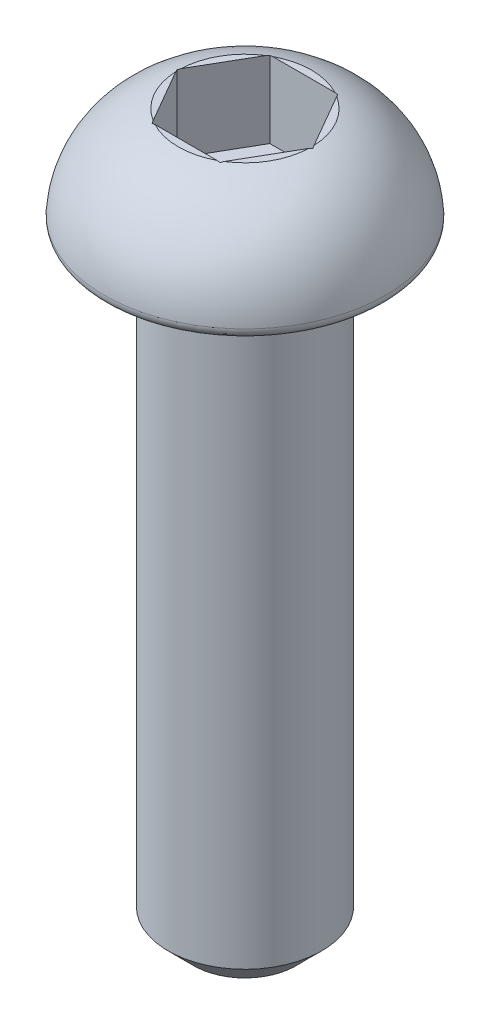
ISO-10303-21;
HEADER;
FILE_DESCRIPTION(('STEP AP214'),'2;1');
FILE_NAME('part.step','',(''),(''),'','','');
FILE_SCHEMA(('AUTOMOTIVE_DESIGN { 1 0 10303 214 1 1 1 1 }'));
ENDSEC;
DATA;
#1=APPLICATION_CONTEXT('core data for automotive mechanical design processes');
#2=APPLICATION_PROTOCOL_DEFINITION('international standard','automotive_design',2000,#1);
#3=PRODUCT_CONTEXT('',#1,'mechanical');
#4=PRODUCT('Part','Part','',(#3));
#5=PRODUCT_RELATED_PRODUCT_CATEGORY('part','',(#4));
#6=PRODUCT_DEFINITION_FORMATION('','',#4);
#7=PRODUCT_DEFINITION_CONTEXT('part definition',#1,'design');
#8=PRODUCT_DEFINITION('design','',#6,#7);
#9=PRODUCT_DEFINITION_SHAPE('','',#8);
#10=(LENGTH_UNIT() NAMED_UNIT(*) SI_UNIT(.MILLI.,.METRE.));
#11=(NAMED_UNIT(*) PLANE_ANGLE_UNIT() SI_UNIT($,.RADIAN.));
#12=(NAMED_UNIT(*) SI_UNIT($,.STERADIAN.) SOLID_ANGLE_UNIT());
#13=UNCERTAINTY_MEASURE_WITH_UNIT(LENGTH_MEASURE(1.E-05),#10,'distance_accuracy_value','');
#14=(GEOMETRIC_REPRESENTATION_CONTEXT(3) GLOBAL_UNCERTAINTY_ASSIGNED_CONTEXT((#13)) GLOBAL_UNIT_ASSIGNED_CONTEXT((#10,
#11,#12)) REPRESENTATION_CONTEXT('',''));
#15=CARTESIAN_POINT('',(0.,0.,0.));
#16=DIRECTION('',(0.,0.,1.));
#17=DIRECTION('',(1.,0.,0.));
#18=AXIS2_PLACEMENT_3D('',#15,#16,#17);
#19=CARTESIAN_POINT('',(0.,0.,0.));
#20=DIRECTION('',(0.,-1.,0.));
#21=DIRECTION('',(0.,0.,-1.));
#22=AXIS2_PLACEMENT_3D('',#19,#20,#21);
#23=PLANE('',#22);
#24=CARTESIAN_POINT('',(0.,0.,0.));
#25=DIRECTION('',(0.,-1.,0.));
#26=DIRECTION('',(0.,0.,-1.));
#27=AXIS2_PLACEMENT_3D('',#24,#25,#26);
#28=CIRCLE('',#27,2.54724235554234);
#29=CARTESIAN_POINT('',(0.,0.,-2.54724235554234));
#30=VERTEX_POINT('',#29);
#31=EDGE_CURVE('E186',#30,#30,#28,.T.);
#32=ORIENTED_EDGE('',*,*,#31,.T.);
#33=EDGE_LOOP('',(#32));
#34=FACE_BOUND('',#33,.T.);
#35=CARTESIAN_POINT('',(0.,0.,0.));
#36=DIRECTION('',(0.,-1.,0.));
#37=DIRECTION('',(0.,0.,-1.));
#38=AXIS2_PLACEMENT_3D('',#35,#36,#37);
#39=CIRCLE('',#38,1.5);
#40=CARTESIAN_POINT('',(0.,0.,-1.5));
#41=VERTEX_POINT('',#40);
#42=EDGE_CURVE('E152',#41,#41,#39,.T.);
#43=ORIENTED_EDGE('',*,*,#42,.F.);
#44=EDGE_LOOP('',(#43));
#45=FACE_BOUND('',#44,.T.);
#46=ADVANCED_FACE('F34',(#34,#45),#23,.T.);
#47=CARTESIAN_POINT('',(0.,2.,0.));
#48=DIRECTION('',(0.,1.,0.));
#49=DIRECTION('',(0.,0.,1.));
#50=AXIS2_PLACEMENT_3D('',#47,#48,#49);
#51=PLANE('',#50);
#52=DIRECTION('',(0.5,0.,-0.866025403784439));
#53=VECTOR('',#52,1.);
#54=CARTESIAN_POINT('',(0.66395280956807,2.,1.15));
#55=LINE('',#54,#53);
#56=CARTESIAN_POINT('',(0.692820323027552,2.,1.1));
#57=VERTEX_POINT('',#56);
#58=CARTESIAN_POINT('',(1.29903810567666,2.,0.0499999999999994));
#59=VERTEX_POINT('',#58);
#60=EDGE_CURVE('E161',#57,#59,#55,.T.);
#61=ORIENTED_EDGE('',*,*,#60,.F.);
#62=CARTESIAN_POINT('',(0.,2.,0.));
#63=DIRECTION('',(0.,-1.,0.));
#64=DIRECTION('',(0.,0.,-1.));
#65=AXIS2_PLACEMENT_3D('',#62,#63,#64);
#66=CIRCLE('',#65,1.3);
#67=EDGE_CURVE('E314',#59,#57,#66,.T.);
#68=ORIENTED_EDGE('',*,*,#67,.F.);
#69=EDGE_LOOP('',(#61,#68));
#70=FACE_BOUND('',#69,.T.);
#71=ADVANCED_FACE('F282',(#70),#51,.T.);
#72=DIRECTION('',(1.,0.,0.));
#73=VECTOR('',#72,1.);
#74=CARTESIAN_POINT('',(-0.66395280956807,2.,1.15));
#75=LINE('',#74,#73);
#76=CARTESIAN_POINT('',(-0.606217782649107,2.,1.15));
#77=VERTEX_POINT('',#76);
#78=CARTESIAN_POINT('',(0.606217782649107,2.,1.15));
#79=VERTEX_POINT('',#78);
#80=EDGE_CURVE('E147',#77,#79,#75,.T.);
#81=ORIENTED_EDGE('',*,*,#80,.F.);
#82=EDGE_CURVE('E316',#79,#77,#66,.T.);
#83=ORIENTED_EDGE('',*,*,#82,.F.);
#84=EDGE_LOOP('',(#81,#83));
#85=FACE_BOUND('',#84,.T.);
#86=ADVANCED_FACE('F288',(#85),#51,.T.);
#87=DIRECTION('',(0.5,0.,0.866025403784438));
#88=VECTOR('',#87,1.);
#89=CARTESIAN_POINT('',(-1.32790561913614,2.,0.));
#90=LINE('',#89,#88);
#91=CARTESIAN_POINT('',(-1.29903810567666,2.,0.0500000000000002));
#92=VERTEX_POINT('',#91);
#93=CARTESIAN_POINT('',(-0.692820323027551,2.,1.1));
#94=VERTEX_POINT('',#93);
#95=EDGE_CURVE('E149',#92,#94,#90,.T.);
#96=ORIENTED_EDGE('',*,*,#95,.F.);
#97=EDGE_CURVE('E318',#94,#92,#66,.T.);
#98=ORIENTED_EDGE('',*,*,#97,.F.);
#99=EDGE_LOOP('',(#96,#98));
#100=FACE_BOUND('',#99,.T.);
#101=ADVANCED_FACE('F342',(#100),#51,.T.);
#102=DIRECTION('',(-0.5,0.,0.866025403784439));
#103=VECTOR('',#102,1.);
#104=CARTESIAN_POINT('',(-0.66395280956807,2.,-1.15));
#105=LINE('',#104,#103);
#106=CARTESIAN_POINT('',(-0.692820323027551,2.,-1.1));
#107=VERTEX_POINT('',#106);
#108=CARTESIAN_POINT('',(-1.29903810567666,2.,-0.0500000000000003));
#109=VERTEX_POINT('',#108);
#110=EDGE_CURVE('E166',#107,#109,#105,.T.);
#111=ORIENTED_EDGE('',*,*,#110,.F.);
#112=EDGE_CURVE('E184',#109,#107,#66,.T.);
#113=ORIENTED_EDGE('',*,*,#112,.F.);
#114=EDGE_LOOP('',(#111,#113));
#115=FACE_BOUND('',#114,.T.);
#116=ADVANCED_FACE('F331',(#115),#51,.T.);
#117=DIRECTION('',(-1.,0.,0.));
#118=VECTOR('',#117,1.);
#119=CARTESIAN_POINT('',(0.663952809568069,2.,-1.15));
#120=LINE('',#119,#118);
#121=CARTESIAN_POINT('',(0.606217782649107,2.,-1.15));
#122=VERTEX_POINT('',#121);
#123=CARTESIAN_POINT('',(-0.606217782649107,2.,-1.15));
#124=VERTEX_POINT('',#123);
#125=EDGE_CURVE('E164',#122,#124,#120,.T.);
#126=ORIENTED_EDGE('',*,*,#125,.F.);
#127=EDGE_CURVE('E171',#124,#122,#66,.T.);
#128=ORIENTED_EDGE('',*,*,#127,.F.);
#129=EDGE_LOOP('',(#126,#128));
#130=FACE_BOUND('',#129,.T.);
#131=ADVANCED_FACE('F307',(#130),#51,.T.);
#132=DIRECTION('',(-0.5,0.,-0.866025403784438));
#133=VECTOR('',#132,1.);
#134=CARTESIAN_POINT('',(1.32790561913614,2.,0.));
#135=LINE('',#134,#133);
#136=CARTESIAN_POINT('',(1.29903810567666,2.,-0.0499999999999994));
#137=VERTEX_POINT('',#136);
#138=CARTESIAN_POINT('',(0.69282032302755,2.,-1.1));
#139=VERTEX_POINT('',#138);
#140=EDGE_CURVE('E49',#137,#139,#135,.T.);
#141=ORIENTED_EDGE('',*,*,#140,.F.);
#142=EDGE_CURVE('E185',#139,#137,#66,.T.);
#143=ORIENTED_EDGE('',*,*,#142,.F.);
#144=EDGE_LOOP('',(#141,#143));
#145=FACE_BOUND('',#144,.T.);
#146=ADVANCED_FACE('F290',(#145),#51,.T.);
#147=CARTESIAN_POINT('',(0.,0.076691427643514,0.));
#148=DIRECTION('',(0.,-1.,0.));
#149=DIRECTION('',(0.,0.,-1.));
#150=AXIS2_PLACEMENT_3D('',#147,#148,#149);
#151=DEGENERATE_TOROIDAL_SURFACE('',#150,0.751470934680709,2.,.T.);
#152=CARTESIAN_POINT('',(0.663837339514232,1.99178669993929,1.1502));
#153=CARTESIAN_POINT('',(0.66878717333089,1.99327644137946,1.14162663634053));
#154=CARTESIAN_POINT('',(0.673740102582228,1.99472242054365,1.13304791123091));
#155=CARTESIAN_POINT('',(0.683652150360132,1.99752685386907,1.11587974087253));
#156=CARTESIAN_POINT('',(0.688611268884708,1.99888530805844,1.10729029562721));
#157=CARTESIAN_POINT('',(0.693573482841972,2.0002,1.0986954889352));
#158=B_SPLINE_CURVE_WITH_KNOTS('',3,(#152,#153,#154,#155,#156,#157),.UNSPECIFIED.,.F.,.F.,(4,2,
4),(0.,0.0300325156416312,0.0600650216231519),.UNSPECIFIED.);
#159=CARTESIAN_POINT('',(0.66395280956807,1.99182146358279,1.15));
#160=VERTEX_POINT('',#159);
#161=EDGE_CURVE('E264',#160,#57,#158,.T.);
#162=ORIENTED_EDGE('',*,*,#161,.F.);
#163=CARTESIAN_POINT('',(0.,2.03658290017349,1.15));
#164=CARTESIAN_POINT('',(0.098646218600147,2.03658732143362,1.15));
#165=CARTESIAN_POINT('',(0.197295101956486,2.03408796152423,1.15));
#166=CARTESIAN_POINT('',(0.394304837949951,2.02310682474313,1.15));
#167=CARTESIAN_POINT('',(0.492665658489158,2.01462440489486,1.15));
#168=CARTESIAN_POINT('',(0.687609728686378,1.98957726871187,1.15));
#169=CARTESIAN_POINT('',(0.784200929312974,1.97307885273518,1.15));
#170=CARTESIAN_POINT('',(0.975057818596466,1.93000622100407,1.15));
#171=CARTESIAN_POINT('',(1.06932598789786,1.90344329758489,1.15));
#172=CARTESIAN_POINT('',(1.27000942224647,1.83324426296719,1.15));
#173=CARTESIAN_POINT('',(1.37568972004873,1.78744372549576,1.15));
#174=CARTESIAN_POINT('',(1.57845042818664,1.67924757225634,1.15));
#175=CARTESIAN_POINT('',(1.67551966120083,1.61683079666585,1.15));
#176=CARTESIAN_POINT('',(1.8578430964694,1.47582375887711,1.15));
#177=CARTESIAN_POINT('',(1.94304549944359,1.39716609459964,1.15));
#178=CARTESIAN_POINT('',(2.09784101718846,1.22574174763031,1.15));
#179=CARTESIAN_POINT('',(2.16743940990664,1.13297985346576,1.15));
#180=CARTESIAN_POINT('',(2.28431419983866,0.94263887552125,1.15));
#181=CARTESIAN_POINT('',(2.33275383814089,0.845772961604736,1.15));
#182=CARTESIAN_POINT('',(2.41188684890319,0.645049587695764,1.15));
#183=CARTESIAN_POINT('',(2.44258507109003,0.541194047036149,1.15));
#184=CARTESIAN_POINT('',(2.48427081779776,0.334046404725987,1.15));
#185=CARTESIAN_POINT('',(2.49601517014892,0.230905918770504,1.15));
#186=CARTESIAN_POINT('',(2.50179966751879,0.0241281883602649,1.15));
#187=CARTESIAN_POINT('',(2.49584075628937,-0.0795090293199227,1.15));
#188=CARTESIAN_POINT('',(2.46658780707738,-0.283077440217687,1.15));
#189=CARTESIAN_POINT('',(2.44349452160948,-0.383037592772008,1.15));
#190=CARTESIAN_POINT('',(2.38096161026423,-0.577676291567684,1.15));
#191=CARTESIAN_POINT('',(2.34152541798826,-0.672355942490544,1.15));
#192=CARTESIAN_POINT('',(2.24727327907491,-0.854473591721951,1.15));
#193=CARTESIAN_POINT('',(2.19236137755517,-0.941861853863798,1.15));
#194=CARTESIAN_POINT('',(2.06898309304621,-1.10654284237712,1.15));
#195=CARTESIAN_POINT('',(2.00050758110401,-1.18382871088677,1.15));
#196=CARTESIAN_POINT('',(1.85001098526993,-1.32858936571327,1.15));
#197=CARTESIAN_POINT('',(1.76765450591879,-1.3957143916501,1.15));
#198=CARTESIAN_POINT('',(1.59361449911652,-1.51612024156412,1.15));
#199=CARTESIAN_POINT('',(1.50194689329583,-1.56942416234802,1.15));
#200=CARTESIAN_POINT('',(1.3442167468046,-1.64633505265362,1.15));
#201=CARTESIAN_POINT('',(1.28002488900966,-1.67388067349761,1.15));
#202=CARTESIAN_POINT('',(1.14942569560088,-1.72309655156327,1.15));
#203=CARTESIAN_POINT('',(1.08301829059227,-1.74476662455823,1.15));
#204=CARTESIAN_POINT('',(0.948299721594118,-1.78271208504272,1.15));
#205=CARTESIAN_POINT('',(0.879979992399287,-1.79895664735316,1.15));
#206=CARTESIAN_POINT('',(0.742372225887791,-1.82648676897236,1.15));
#207=CARTESIAN_POINT('',(0.673084213384437,-1.83777245511816,1.15));
#208=CARTESIAN_POINT('',(0.491428640373657,-1.8618030535964,1.15));
#209=CARTESIAN_POINT('',(0.378625107961637,-1.87122074908676,1.15));
#210=CARTESIAN_POINT('',(0.209143758579499,-1.87958699044929,1.15));
#211=CARTESIAN_POINT('',(0.152562345228347,-1.88141490888953,1.15));
#212=CARTESIAN_POINT('',(0.0393669602172776,-1.88335114487218,1.15));
#213=CARTESIAN_POINT('',(-0.0172470100143041,-1.883459532838,1.15));
#214=CARTESIAN_POINT('',(-0.130350030932136,-1.88197557574409,1.15));
#215=CARTESIAN_POINT('',(-0.186839119823327,-1.88038635915171,1.15));
#216=CARTESIAN_POINT('',(-0.299728920798325,-1.87531771771226,1.15));
#217=CARTESIAN_POINT('',(-0.356129628836693,-1.87183820873768,1.15));
#218=CARTESIAN_POINT('',(-0.524916952582429,-1.85805049067533,1.15));
#219=CARTESIAN_POINT('',(-0.637092371817397,-1.84439266677423,1.15));
#220=CARTESIAN_POINT('',(-0.810017493876797,-1.81361696288777,1.15));
#221=CARTESIAN_POINT('',(-0.871521077506692,-1.80071656706703,1.15));
#222=CARTESIAN_POINT('',(-0.993496408589721,-1.77064052799502,1.15));
#223=CARTESIAN_POINT('',(-1.05396806098029,-1.75346449311514,1.15));
#224=CARTESIAN_POINT('',(-1.17323439190626,-1.71454198802947,1.15));
#225=CARTESIAN_POINT('',(-1.2320335047974,-1.69280919801169,1.15));
#226=CARTESIAN_POINT('',(-1.34764514507638,-1.64452542038476,1.15));
#227=CARTESIAN_POINT('',(-1.40445721463237,-1.61797333097724,1.15));
#228=CARTESIAN_POINT('',(-1.51607405614635,-1.55969669663654,1.15));
#229=CARTESIAN_POINT('',(-1.57085410804412,-1.52792462132762,1.15));
#230=CARTESIAN_POINT('',(-1.67726545993891,-1.45943403628238,1.15));
#231=CARTESIAN_POINT('',(-1.72889554802264,-1.42271363995312,1.15));
#232=CARTESIAN_POINT('',(-1.82847105838098,-1.34445894230347,1.15));
#233=CARTESIAN_POINT('',(-1.87641252573548,-1.30291959053453,1.15));
#234=CARTESIAN_POINT('',(-1.9680035552563,-1.21534492943057,1.15));
#235=CARTESIAN_POINT('',(-2.01165174969555,-1.16930819659477,1.15));
#236=CARTESIAN_POINT('',(-2.12614975655006,-1.03572622565891,1.15));
#237=CARTESIAN_POINT('',(-2.19186050387076,-0.943665750390142,1.15));
#238=CARTESIAN_POINT('',(-2.30546191326039,-0.749288259753581,1.15));
#239=CARTESIAN_POINT('',(-2.35337031200657,-0.646981582540756,1.15));
#240=CARTESIAN_POINT('',(-2.42703869947872,-0.442585671523526,1.15));
#241=CARTESIAN_POINT('',(-2.45409068083514,-0.340961259178402,1.15));
#242=CARTESIAN_POINT('',(-2.49032992545249,-0.134567326214733,1.15));
#243=CARTESIAN_POINT('',(-2.49951787124879,-0.0297979259127926,1.15));
#244=CARTESIAN_POINT('',(-2.49971519023315,0.177457556639515,1.15));
#245=CARTESIAN_POINT('',(-2.49111740474565,0.279943506757529,1.15));
#246=CARTESIAN_POINT('',(-2.45681698932696,0.482000924000085,1.15));
#247=CARTESIAN_POINT('',(-2.43111591392285,0.581572655140941,1.15));
#248=CARTESIAN_POINT('',(-2.36347334234934,0.774935615001325,1.15));
#249=CARTESIAN_POINT('',(-2.32154526289618,0.868731545166596,1.15));
#250=CARTESIAN_POINT('',(-2.22279701257776,1.04811167401887,1.15));
#251=CARTESIAN_POINT('',(-2.16597630912103,1.13369557887707,1.15));
#252=CARTESIAN_POINT('',(-2.03810854833738,1.29594922041055,1.15));
#253=CARTESIAN_POINT('',(-1.96682676359936,1.37243365695663,1.15));
#254=CARTESIAN_POINT('',(-1.81295905623226,1.51300240336353,1.15));
#255=CARTESIAN_POINT('',(-1.73037090646585,1.57708426413665,1.15));
#256=CARTESIAN_POINT('',(-1.5520613820707,1.69471516717586,1.15));
#257=CARTESIAN_POINT('',(-1.45589046579648,1.74757961403836,1.15));
#258=CARTESIAN_POINT('',(-1.25692243260643,1.83837035879711,1.15));
#259=CARTESIAN_POINT('',(-1.15413109373742,1.87630948273586,1.15));
#260=CARTESIAN_POINT('',(-0.964938329481516,1.93242013134816,1.15));
#261=CARTESIAN_POINT('',(-0.879225780531216,1.95299866436732,1.15));
#262=CARTESIAN_POINT('',(-0.706280939870257,1.98646029403696,1.15));
#263=CARTESIAN_POINT('',(-0.6190475593282,1.9993376228744,1.15));
#264=CARTESIAN_POINT('',(-0.443289273005161,2.01901301040914,1.15));
#265=CARTESIAN_POINT('',(-0.354759586940948,2.02576557714995,1.15));
#266=CARTESIAN_POINT('',(-0.17748732142704,2.03454856601354,1.15));
#267=CARTESIAN_POINT('',(-0.0887447390438819,2.03657892269132,1.15));
#268=CARTESIAN_POINT('',(0.,2.03658290017349,1.15));
#269=B_SPLINE_CURVE_WITH_KNOTS('',3,(#163,#164,#165,#166,#167,#168,#169,#170,#171,#172,#173,
#174,#175,#176,#177,#178,#179,#180,#181,#182,#183,#184,#185,#186,#187,#188,#189,#190,#191,#192,
#193,#194,#195,#196,#197,#198,#199,#200,#201,#202,#203,#204,#205,#206,#207,#208,#209,#210,#211,
#212,#213,#214,#215,#216,#217,#218,#219,#220,#221,#222,#223,#224,#225,#226,#227,#228,#229,#230,
#231,#232,#233,#234,#235,#236,#237,#238,#239,#240,#241,#242,#243,#244,#245,#246,#247,#248,#249,
#250,#251,#252,#253,#254,#255,#256,#257,#258,#259,#260,#261,#262,#263,#264,#265,#266,#267,#268),
.UNSPECIFIED.,.T.,.F.,(4,2,2,2,2,2,2,2,2,2,2,2,2,2,2,2,2,2,2,2,2,2,2,2,2,2,2,2,2,2,2,2,2,2,2,2,
2,2,2,2,2,2,2,2,2,2,2,2,2,2,2,2,4),(0.,0.295902440396797,0.591836685142885,0.88536388192649,
1.1785627130153,1.52269996813138,1.86727757612131,2.21331506104864,2.5592353240376,
2.88250449229488,3.2056852510601,3.51561009227793,3.82551841185847,4.13185195746594,
4.43812117581053,4.74633280791623,5.05475259026988,5.37212175852073,5.68895709402482,
5.89824437929793,6.10753822597639,6.31800171851667,6.52845982755554,6.86760372007158,
7.03742508416335,7.20723949320035,7.37674149510497,7.54625104131724,7.8846605033158,
8.07306010337971,8.26147696632307,8.44933606655962,8.63723816976182,8.82695710833894,
9.01674858473973,9.20674079803173,9.39679334327464,9.73415597564318,10.0711815829047,
10.3851290507443,10.6990645232839,11.0061400458043,11.3131876618792,11.6199819471461,
11.9267872055172,12.2390410643218,12.5513565198947,12.8792462443636,13.2068535787986,
13.4709069754266,13.7351578878529,14.0013558354432,14.267557472243),.UNSPECIFIED.);
#270=EDGE_CURVE('E57',#79,#160,#269,.T.);
#271=ORIENTED_EDGE('',*,*,#270,.F.);
#272=ORIENTED_EDGE('',*,*,#82,.T.);
#273=CARTESIAN_POINT('',(-0.66395280956807,1.99182146358212,1.15));
#274=VERTEX_POINT('',#273);
#275=EDGE_CURVE('E260',#274,#77,#269,.T.);
#276=ORIENTED_EDGE('',*,*,#275,.F.);
#277=CARTESIAN_POINT('',(-0.693573482841972,2.0002,1.0986954889352));
#278=CARTESIAN_POINT('',(-0.688611268884708,1.99888530805844,1.10729029562721));
#279=CARTESIAN_POINT('',(-0.683652150360132,1.99752685386907,1.11587974087253));
#280=CARTESIAN_POINT('',(-0.673740102582228,1.99472242054365,1.13304791123091));
#281=CARTESIAN_POINT('',(-0.66878717333089,1.99327644137946,1.14162663634053));
#282=CARTESIAN_POINT('',(-0.663837339514232,1.99178669993929,1.1502));
#283=B_SPLINE_CURVE_WITH_KNOTS('',3,(#277,#278,#279,#280,#281,#282),.UNSPECIFIED.,.F.,.F.,(4,2,
4),(0.,0.0300325059815209,0.0600650216231522),.UNSPECIFIED.);
#284=EDGE_CURVE('E255',#94,#274,#283,.T.);
#285=ORIENTED_EDGE('',*,*,#284,.F.);
#286=ORIENTED_EDGE('',*,*,#97,.T.);
#287=CARTESIAN_POINT('',(-1.32802108918998,1.99178669993929,-0.000199999999999881));
#288=CARTESIAN_POINT('',(-1.32307125537332,1.99327644137946,0.00837336365947469));
#289=CARTESIAN_POINT('',(-1.31811832612198,1.99472242054365,0.0169520887690861));
#290=CARTESIAN_POINT('',(-1.30820627834408,1.99752685386907,0.0341202591274678));
#291=CARTESIAN_POINT('',(-1.3032471598195,1.99888530805844,0.0427097043727891));
#292=CARTESIAN_POINT('',(-1.29828494586224,2.0002,0.0513045110647981));
#293=B_SPLINE_CURVE_WITH_KNOTS('',3,(#287,#288,#289,#290,#291,#292),.UNSPECIFIED.,.F.,.F.,(4,2,
4),(0.,0.030032515641632,0.0600650216231535),.UNSPECIFIED.);
#294=CARTESIAN_POINT('',(-1.32790561913614,1.99182146358212,0.));
#295=VERTEX_POINT('',#294);
#296=EDGE_CURVE('E250',#295,#92,#293,.T.);
#297=ORIENTED_EDGE('',*,*,#296,.F.);
#298=CARTESIAN_POINT('',(-1.29828494586224,2.0002,-0.0513045110647978));
#299=CARTESIAN_POINT('',(-1.3032471598195,1.99888530805844,-0.0427097043727888));
#300=CARTESIAN_POINT('',(-1.30820627834408,1.99752685386907,-0.0341202591274676));
#301=CARTESIAN_POINT('',(-1.31811832612198,1.99472242054365,-0.016952088769086));
#302=CARTESIAN_POINT('',(-1.32307125537332,1.99327644137946,-0.00837336365947457));
#303=CARTESIAN_POINT('',(-1.32802108918998,1.99178669993929,0.000199999999999972));
#304=B_SPLINE_CURVE_WITH_KNOTS('',3,(#298,#299,#300,#301,#302,#303),.UNSPECIFIED.,.F.,.F.,(4,2,
4),(0.,0.0300325059815215,0.0600650216231534),.UNSPECIFIED.);
#305=EDGE_CURVE('E230',#109,#295,#304,.T.);
#306=ORIENTED_EDGE('',*,*,#305,.F.);
#307=ORIENTED_EDGE('',*,*,#112,.T.);
#308=CARTESIAN_POINT('',(-0.663837339514232,1.99178669993929,-1.1502));
#309=CARTESIAN_POINT('',(-0.66878717333089,1.99327644137946,-1.14162663634053));
#310=CARTESIAN_POINT('',(-0.673740102582228,1.99472242054365,-1.13304791123091));
#311=CARTESIAN_POINT('',(-0.683652150360133,1.99752685386907,-1.11587974087253));
#312=CARTESIAN_POINT('',(-0.688611268884709,1.99888530805844,-1.10729029562721));
#313=CARTESIAN_POINT('',(-0.693573482841973,2.0002,-1.0986954889352));
#314=B_SPLINE_CURVE_WITH_KNOTS('',3,(#308,#309,#310,#311,#312,#313),.UNSPECIFIED.,.F.,.F.,(4,2,
4),(0.,0.0300325156416316,0.0600650216231527),.UNSPECIFIED.);
#315=CARTESIAN_POINT('',(-0.66395280956807,1.99182146358279,-1.15));
#316=VERTEX_POINT('',#315);
#317=EDGE_CURVE('E225',#316,#107,#314,.T.);
#318=ORIENTED_EDGE('',*,*,#317,.F.);
#319=CARTESIAN_POINT('',(0.,2.03658290017349,-1.15));
#320=CARTESIAN_POINT('',(-0.0986462186001475,2.03658732143362,-1.15));
#321=CARTESIAN_POINT('',(-0.197295101956487,2.03408796152423,-1.15));
#322=CARTESIAN_POINT('',(-0.394304837949951,2.02310682474313,-1.15));
#323=CARTESIAN_POINT('',(-0.492665658489158,2.01462440489486,-1.15));
#324=CARTESIAN_POINT('',(-0.687609728686379,1.98957726871187,-1.15));
#325=CARTESIAN_POINT('',(-0.784200929312975,1.97307885273518,-1.15));
#326=CARTESIAN_POINT('',(-0.975057818596467,1.93000622100407,-1.15));
#327=CARTESIAN_POINT('',(-1.06932598789786,1.90344329758489,-1.15));
#328=CARTESIAN_POINT('',(-1.27000942224647,1.83324426296719,-1.15));
#329=CARTESIAN_POINT('',(-1.37568972004873,1.78744372549576,-1.15));
#330=CARTESIAN_POINT('',(-1.57845042818664,1.67924757225634,-1.15));
#331=CARTESIAN_POINT('',(-1.67551966120083,1.61683079666585,-1.15));
#332=CARTESIAN_POINT('',(-1.8578430964694,1.47582375887711,-1.15));
#333=CARTESIAN_POINT('',(-1.94304549944359,1.39716609459964,-1.15));
#334=CARTESIAN_POINT('',(-2.09784101718846,1.22574174763031,-1.15));
#335=CARTESIAN_POINT('',(-2.16743940990664,1.13297985346576,-1.15));
#336=CARTESIAN_POINT('',(-2.28431419983867,0.942638875521249,-1.15));
#337=CARTESIAN_POINT('',(-2.33275383814089,0.845772961604735,-1.15));
#338=CARTESIAN_POINT('',(-2.41188684890319,0.645049587695763,-1.15));
#339=CARTESIAN_POINT('',(-2.44258507109003,0.541194047036148,-1.15));
#340=CARTESIAN_POINT('',(-2.48427081779776,0.334046404725987,-1.15));
#341=CARTESIAN_POINT('',(-2.49601517014892,0.230905918770504,-1.15));
#342=CARTESIAN_POINT('',(-2.50179966751879,0.0241281883602644,-1.15));
#343=CARTESIAN_POINT('',(-2.49584075628937,-0.0795090293199232,-1.15));
#344=CARTESIAN_POINT('',(-2.46658780707738,-0.283077440217688,-1.15));
#345=CARTESIAN_POINT('',(-2.44349452160948,-0.383037592772009,-1.15));
#346=CARTESIAN_POINT('',(-2.38096161026423,-0.577676291567685,-1.15));
#347=CARTESIAN_POINT('',(-2.34152541798826,-0.672355942490545,-1.15));
#348=CARTESIAN_POINT('',(-2.24727327907491,-0.854473591721952,-1.15));
#349=CARTESIAN_POINT('',(-2.19236137755517,-0.941861853863799,-1.15));
#350=CARTESIAN_POINT('',(-2.06898309304621,-1.10654284237712,-1.15));
#351=CARTESIAN_POINT('',(-2.00050758110401,-1.18382871088677,-1.15));
#352=CARTESIAN_POINT('',(-1.85001098526993,-1.32858936571327,-1.15));
#353=CARTESIAN_POINT('',(-1.76765450591879,-1.3957143916501,-1.15));
#354=CARTESIAN_POINT('',(-1.59361449911652,-1.51612024156412,-1.15));
#355=CARTESIAN_POINT('',(-1.50194689329583,-1.56942416234802,-1.15));
#356=CARTESIAN_POINT('',(-1.3442167468046,-1.64633505265362,-1.15));
#357=CARTESIAN_POINT('',(-1.28002488900966,-1.67388067349761,-1.15));
#358=CARTESIAN_POINT('',(-1.14942569560088,-1.72309655156327,-1.15));
#359=CARTESIAN_POINT('',(-1.08301829059227,-1.74476662455823,-1.15));
#360=CARTESIAN_POINT('',(-0.948299721594117,-1.78271208504273,-1.15));
#361=CARTESIAN_POINT('',(-0.879979992399286,-1.79895664735316,-1.15));
#362=CARTESIAN_POINT('',(-0.74237222588779,-1.82648676897236,-1.15));
#363=CARTESIAN_POINT('',(-0.673084213384436,-1.83777245511816,-1.15));
#364=CARTESIAN_POINT('',(-0.491428640373656,-1.8618030535964,-1.15));
#365=CARTESIAN_POINT('',(-0.378625107961636,-1.87122074908676,-1.15));
#366=CARTESIAN_POINT('',(-0.209143758579498,-1.87958699044929,-1.15));
#367=CARTESIAN_POINT('',(-0.152562345228346,-1.88141490888953,-1.15));
#368=CARTESIAN_POINT('',(-0.0393669602172767,-1.88335114487218,-1.15));
#369=CARTESIAN_POINT('',(0.0172470100143049,-1.883459532838,-1.15));
#370=CARTESIAN_POINT('',(0.130350030932137,-1.88197557574409,-1.15));
#371=CARTESIAN_POINT('',(0.186839119823328,-1.88038635915171,-1.15));
#372=CARTESIAN_POINT('',(0.299728920798326,-1.87531771771226,-1.15));
#373=CARTESIAN_POINT('',(0.356129628836694,-1.87183820873768,-1.15));
#374=CARTESIAN_POINT('',(0.524916952582429,-1.85805049067533,-1.15));
#375=CARTESIAN_POINT('',(0.637092371817398,-1.84439266677423,-1.15));
#376=CARTESIAN_POINT('',(0.810017493876798,-1.81361696288777,-1.15));
#377=CARTESIAN_POINT('',(0.871521077506693,-1.80071656706703,-1.15));
#378=CARTESIAN_POINT('',(0.993496408589723,-1.77064052799502,-1.15));
#379=CARTESIAN_POINT('',(1.05396806098029,-1.75346449311514,-1.15));
#380=CARTESIAN_POINT('',(1.17323439190626,-1.71454198802947,-1.15));
#381=CARTESIAN_POINT('',(1.2320335047974,-1.69280919801169,-1.15));
#382=CARTESIAN_POINT('',(1.34764514507638,-1.64452542038476,-1.15));
#383=CARTESIAN_POINT('',(1.40445721463237,-1.61797333097724,-1.15));
#384=CARTESIAN_POINT('',(1.51607405614635,-1.55969669663654,-1.15));
#385=CARTESIAN_POINT('',(1.57085410804412,-1.52792462132762,-1.15));
#386=CARTESIAN_POINT('',(1.67726545993891,-1.45943403628238,-1.15));
#387=CARTESIAN_POINT('',(1.72889554802264,-1.42271363995312,-1.15));
#388=CARTESIAN_POINT('',(1.82847105838098,-1.34445894230347,-1.15));
#389=CARTESIAN_POINT('',(1.87641252573548,-1.30291959053453,-1.15));
#390=CARTESIAN_POINT('',(1.9680035552563,-1.21534492943057,-1.15));
#391=CARTESIAN_POINT('',(2.01165174969555,-1.16930819659477,-1.15));
#392=CARTESIAN_POINT('',(2.12614975655006,-1.03572622565891,-1.15));
#393=CARTESIAN_POINT('',(2.19186050387076,-0.943665750390142,-1.15));
#394=CARTESIAN_POINT('',(2.30546191326039,-0.749288259753581,-1.15));
#395=CARTESIAN_POINT('',(2.35337031200657,-0.646981582540756,-1.15));
#396=CARTESIAN_POINT('',(2.42703869947872,-0.442585671523526,-1.15));
#397=CARTESIAN_POINT('',(2.45409068083514,-0.340961259178402,-1.15));
#398=CARTESIAN_POINT('',(2.49032992545249,-0.134567326214733,-1.15));
#399=CARTESIAN_POINT('',(2.49951787124879,-0.0297979259127928,-1.15));
#400=CARTESIAN_POINT('',(2.49971519023315,0.177457556639515,-1.15));
#401=CARTESIAN_POINT('',(2.49111740474565,0.279943506757529,-1.15));
#402=CARTESIAN_POINT('',(2.45681698932696,0.482000924000085,-1.15));
#403=CARTESIAN_POINT('',(2.43111591392285,0.581572655140941,-1.15));
#404=CARTESIAN_POINT('',(2.36347334234934,0.774935615001325,-1.15));
#405=CARTESIAN_POINT('',(2.32154526289618,0.868731545166596,-1.15));
#406=CARTESIAN_POINT('',(2.22279701257776,1.04811167401887,-1.15));
#407=CARTESIAN_POINT('',(2.16597630912103,1.13369557887707,-1.15));
#408=CARTESIAN_POINT('',(2.03810854833738,1.29594922041055,-1.15));
#409=CARTESIAN_POINT('',(1.96682676359936,1.37243365695663,-1.15));
#410=CARTESIAN_POINT('',(1.81295905623226,1.51300240336353,-1.15));
#411=CARTESIAN_POINT('',(1.73037090646585,1.57708426413665,-1.15));
#412=CARTESIAN_POINT('',(1.5520613820707,1.69471516717586,-1.15));
#413=CARTESIAN_POINT('',(1.45589046579648,1.74757961403836,-1.15));
#414=CARTESIAN_POINT('',(1.25692243260643,1.83837035879711,-1.15));
#415=CARTESIAN_POINT('',(1.15413109373742,1.87630948273586,-1.15));
#416=CARTESIAN_POINT('',(0.964938329481515,1.93242013134816,-1.15));
#417=CARTESIAN_POINT('',(0.879225780531215,1.95299866436732,-1.15));
#418=CARTESIAN_POINT('',(0.706280939870256,1.98646029403696,-1.15));
#419=CARTESIAN_POINT('',(0.619047559328199,1.9993376228744,-1.15));
#420=CARTESIAN_POINT('',(0.44328927300516,2.01901301040914,-1.15));
#421=CARTESIAN_POINT('',(0.354759586940947,2.02576557714995,-1.15));
#422=CARTESIAN_POINT('',(0.17748732142704,2.03454856601354,-1.15));
#423=CARTESIAN_POINT('',(0.0887447390438815,2.03657892269132,-1.15));
#424=CARTESIAN_POINT('',(0.,2.03658290017349,-1.15));
#425=B_SPLINE_CURVE_WITH_KNOTS('',3,(#319,#320,#321,#322,#323,#324,#325,#326,#327,#328,#329,
#330,#331,#332,#333,#334,#335,#336,#337,#338,#339,#340,#341,#342,#343,#344,#345,#346,#347,#348,
#349,#350,#351,#352,#353,#354,#355,#356,#357,#358,#359,#360,#361,#362,#363,#364,#365,#366,#367,
#368,#369,#370,#371,#372,#373,#374,#375,#376,#377,#378,#379,#380,#381,#382,#383,#384,#385,#386,
#387,#388,#389,#390,#391,#392,#393,#394,#395,#396,#397,#398,#399,#400,#401,#402,#403,#404,#405,
#406,#407,#408,#409,#410,#411,#412,#413,#414,#415,#416,#417,#418,#419,#420,#421,#422,#423,#424),
.UNSPECIFIED.,.T.,.F.,(4,2,2,2,2,2,2,2,2,2,2,2,2,2,2,2,2,2,2,2,2,2,2,2,2,2,2,2,2,2,2,2,2,2,2,2,
2,2,2,2,2,2,2,2,2,2,2,2,2,2,2,2,4),(0.,0.295902440396797,0.591836685142885,0.88536388192649,
1.1785627130153,1.52269996813138,1.86727757612131,2.21331506104864,2.5592353240376,
2.88250449229488,3.2056852510601,3.51561009227793,3.82551841185847,4.13185195746594,
4.43812117581053,4.74633280791623,5.05475259026988,5.37212175852073,5.68895709402482,
5.89824437929793,6.10753822597639,6.31800171851667,6.52845982755554,6.86760372007158,
7.03742508416334,7.20723949320035,7.37674149510497,7.54625104131724,7.8846605033158,
8.07306010337971,8.26147696632306,8.44933606655962,8.63723816976182,8.82695710833893,
9.01674858473973,9.20674079803173,9.39679334327464,9.73415597564318,10.0711815829047,
10.3851290507443,10.6990645232839,11.0061400458043,11.3131876618792,11.6199819471461,
11.9267872055172,12.2390410643218,12.5513565198947,12.8792462443636,13.2068535787986,
13.4709069754266,13.7351578878529,14.0013558354432,14.2675574722429),.UNSPECIFIED.);
#426=EDGE_CURVE('E224',#124,#316,#425,.T.);
#427=ORIENTED_EDGE('',*,*,#426,.F.);
#428=ORIENTED_EDGE('',*,*,#127,.T.);
#429=CARTESIAN_POINT('',(0.663952809568069,1.99182146358212,-1.15));
#430=VERTEX_POINT('',#429);
#431=EDGE_CURVE('E199',#430,#122,#425,.T.);
#432=ORIENTED_EDGE('',*,*,#431,.F.);
#433=CARTESIAN_POINT('',(0.693573482841971,2.0002,-1.0986954889352));
#434=CARTESIAN_POINT('',(0.688611268884707,1.99888530805844,-1.10729029562721));
#435=CARTESIAN_POINT('',(0.683652150360131,1.99752685386907,-1.11587974087253));
#436=CARTESIAN_POINT('',(0.673740102582227,1.99472242054365,-1.13304791123091));
#437=CARTESIAN_POINT('',(0.668787173330889,1.99327644137946,-1.14162663634053));
#438=CARTESIAN_POINT('',(0.663837339514231,1.99178669993929,-1.1502));
#439=B_SPLINE_CURVE_WITH_KNOTS('',3,(#433,#434,#435,#436,#437,#438),.UNSPECIFIED.,.F.,.F.,(4,2,
4),(0.,0.0300325059815199,0.0600650216231502),.UNSPECIFIED.);
#440=EDGE_CURVE('E192',#139,#430,#439,.T.);
#441=ORIENTED_EDGE('',*,*,#440,.F.);
#442=ORIENTED_EDGE('',*,*,#142,.T.);
#443=CARTESIAN_POINT('',(1.32802108918998,1.99178669993929,0.000199999999999741));
#444=CARTESIAN_POINT('',(1.32307125537332,1.99327644137946,-0.00837336365947432));
#445=CARTESIAN_POINT('',(1.31811832612198,1.99472242054365,-0.0169520887690852));
#446=CARTESIAN_POINT('',(1.30820627834408,1.99752685386907,-0.034120259127466));
#447=CARTESIAN_POINT('',(1.3032471598195,1.99888530805844,-0.0427097043727867));
#448=CARTESIAN_POINT('',(1.29828494586224,2.0002,-0.0513045110647953));
#449=B_SPLINE_CURVE_WITH_KNOTS('',3,(#443,#444,#445,#446,#447,#448),.UNSPECIFIED.,.F.,.F.,(4,2,
4),(0.,0.0300325156416303,0.0600650216231501),.UNSPECIFIED.);
#450=CARTESIAN_POINT('',(1.32790561913614,1.99182146358279,0.));
#451=VERTEX_POINT('',#450);
#452=EDGE_CURVE('E215',#451,#137,#449,.T.);
#453=ORIENTED_EDGE('',*,*,#452,.F.);
#454=CARTESIAN_POINT('',(1.29828494586224,2.0002,0.0513045110647961));
#455=CARTESIAN_POINT('',(1.3032471598195,1.99888530805844,0.0427097043727873));
#456=CARTESIAN_POINT('',(1.30820627834408,1.99752685386907,0.0341202591274664));
#457=CARTESIAN_POINT('',(1.31811832612198,1.99472242054365,0.0169520887690852));
#458=CARTESIAN_POINT('',(1.32307125537332,1.99327644137946,0.00837336365947403));
#459=CARTESIAN_POINT('',(1.32802108918998,1.99178669993929,-0.00020000000000029));
#460=B_SPLINE_CURVE_WITH_KNOTS('',3,(#454,#455,#456,#457,#458,#459),.UNSPECIFIED.,.F.,.F.,(4,2,
4),(0.,0.0300325059815206,0.0600650216231517),.UNSPECIFIED.);
#461=EDGE_CURVE('E130',#59,#451,#460,.T.);
#462=ORIENTED_EDGE('',*,*,#461,.F.);
#463=ORIENTED_EDGE('',*,*,#67,.T.);
#464=EDGE_LOOP('',(#162,#271,#272,#276,#285,#286,#297,#306,#307,#318,#427,#428,#432,#441,#442,
#453,#462,#463));
#465=FACE_BOUND('',#464,.T.);
#466=CARTESIAN_POINT('',(0.,0.213700952484054,0.));
#467=DIRECTION('',(0.,-1.,0.));
#468=DIRECTION('',(0.,0.,-1.));
#469=AXIS2_PLACEMENT_3D('',#466,#467,#468);
#470=CIRCLE('',#469,2.74677251341586);
#471=CARTESIAN_POINT('',(0.,0.213700952484054,-2.74677251341586));
#472=VERTEX_POINT('',#471);
#473=EDGE_CURVE('E189',#472,#472,#470,.F.);
#474=ORIENTED_EDGE('',*,*,#473,.T.);
#475=EDGE_LOOP('',(#474));
#476=FACE_BOUND('',#475,.T.);
#477=ADVANCED_FACE('F204',(#465,#476),#151,.T.);
#478=CARTESIAN_POINT('',(0.,0.2,0.));
#479=DIRECTION('',(0.,-1.,0.));
#480=DIRECTION('',(0.,0.,-1.));
#481=AXIS2_PLACEMENT_3D('',#478,#479,#480);
#482=TOROIDAL_SURFACE('',#481,2.54724235554234,0.2);
#483=ORIENTED_EDGE('',*,*,#473,.F.);
#484=EDGE_LOOP('',(#483));
#485=FACE_BOUND('',#484,.T.);
#486=ORIENTED_EDGE('',*,*,#31,.F.);
#487=EDGE_LOOP('',(#486));
#488=FACE_BOUND('',#487,.T.);
#489=ADVANCED_FACE('F292',(#485,#488),#482,.T.);
#490=CARTESIAN_POINT('',(0.66395280956807,0.5,1.15));
#491=DIRECTION('',(0.866025403784439,0.,0.499999999999999));
#492=DIRECTION('',(0.5,0.,-0.866025403784439));
#493=AXIS2_PLACEMENT_3D('',#490,#491,#492);
#494=PLANE('',#493);
#495=ORIENTED_EDGE('',*,*,#161,.T.);
#496=ORIENTED_EDGE('',*,*,#60,.T.);
#497=ORIENTED_EDGE('',*,*,#461,.T.);
#498=DIRECTION('',(0.,1.,0.));
#499=VECTOR('',#498,1.);
#500=CARTESIAN_POINT('',(1.32790561913614,0.5,0.));
#501=LINE('',#500,#499);
#502=CARTESIAN_POINT('',(1.32790561913614,0.5,0.));
#503=VERTEX_POINT('',#502);
#504=EDGE_CURVE('E123',#503,#451,#501,.T.);
#505=ORIENTED_EDGE('',*,*,#504,.F.);
#506=DIRECTION('',(0.5,0.,-0.866025403784439));
#507=VECTOR('',#506,1.);
#508=CARTESIAN_POINT('',(0.66395280956807,0.5,1.15));
#509=LINE('',#508,#507);
#510=CARTESIAN_POINT('',(0.66395280956807,0.5,1.15));
#511=VERTEX_POINT('',#510);
#512=EDGE_CURVE('E127',#511,#503,#509,.T.);
#513=ORIENTED_EDGE('',*,*,#512,.F.);
#514=DIRECTION('',(0.,1.,0.));
#515=VECTOR('',#514,1.);
#516=CARTESIAN_POINT('',(0.66395280956807,0.5,1.15));
#517=LINE('',#516,#515);
#518=EDGE_CURVE('E169',#511,#160,#517,.T.);
#519=ORIENTED_EDGE('',*,*,#518,.T.);
#520=EDGE_LOOP('',(#495,#496,#497,#505,#513,#519));
#521=FACE_BOUND('',#520,.T.);
#522=ADVANCED_FACE('F125',(#521),#494,.F.);
#523=CARTESIAN_POINT('',(-0.66395280956807,0.5,1.15));
#524=DIRECTION('',(0.,0.,1.));
#525=DIRECTION('',(1.,0.,0.));
#526=AXIS2_PLACEMENT_3D('',#523,#524,#525);
#527=PLANE('',#526);
#528=ORIENTED_EDGE('',*,*,#270,.T.);
#529=ORIENTED_EDGE('',*,*,#518,.F.);
#530=DIRECTION('',(1.,0.,0.));
#531=VECTOR('',#530,1.);
#532=CARTESIAN_POINT('',(-0.66395280956807,0.5,1.15));
#533=LINE('',#532,#531);
#534=CARTESIAN_POINT('',(-0.66395280956807,0.5,1.15));
#535=VERTEX_POINT('',#534);
#536=EDGE_CURVE('E133',#535,#511,#533,.T.);
#537=ORIENTED_EDGE('',*,*,#536,.F.);
#538=DIRECTION('',(0.,1.,0.));
#539=VECTOR('',#538,1.);
#540=CARTESIAN_POINT('',(-0.66395280956807,0.5,1.15));
#541=LINE('',#540,#539);
#542=EDGE_CURVE('E172',#535,#274,#541,.T.);
#543=ORIENTED_EDGE('',*,*,#542,.T.);
#544=ORIENTED_EDGE('',*,*,#275,.T.);
#545=ORIENTED_EDGE('',*,*,#80,.T.);
#546=EDGE_LOOP('',(#528,#529,#537,#543,#544,#545));
#547=FACE_BOUND('',#546,.T.);
#548=ADVANCED_FACE('F245',(#547),#527,.F.);
#549=CARTESIAN_POINT('',(-1.32790561913614,0.5,0.));
#550=DIRECTION('',(-0.866025403784439,0.,0.5));
#551=DIRECTION('',(0.5,0.,0.866025403784439));
#552=AXIS2_PLACEMENT_3D('',#549,#550,#551);
#553=PLANE('',#552);
#554=ORIENTED_EDGE('',*,*,#296,.T.);
#555=ORIENTED_EDGE('',*,*,#95,.T.);
#556=ORIENTED_EDGE('',*,*,#284,.T.);
#557=ORIENTED_EDGE('',*,*,#542,.F.);
#558=DIRECTION('',(0.5,0.,0.866025403784438));
#559=VECTOR('',#558,1.);
#560=CARTESIAN_POINT('',(-1.32790561913614,0.5,0.));
#561=LINE('',#560,#559);
#562=CARTESIAN_POINT('',(-1.32790561913614,0.5,0.));
#563=VERTEX_POINT('',#562);
#564=EDGE_CURVE('E158',#563,#535,#561,.T.);
#565=ORIENTED_EDGE('',*,*,#564,.F.);
#566=DIRECTION('',(0.,1.,0.));
#567=VECTOR('',#566,1.);
#568=CARTESIAN_POINT('',(-1.32790561913614,0.5,0.));
#569=LINE('',#568,#567);
#570=EDGE_CURVE('E175',#563,#295,#569,.T.);
#571=ORIENTED_EDGE('',*,*,#570,.T.);
#572=EDGE_LOOP('',(#554,#555,#556,#557,#565,#571));
#573=FACE_BOUND('',#572,.T.);
#574=ADVANCED_FACE('F239',(#573),#553,.F.);
#575=CARTESIAN_POINT('',(-0.66395280956807,0.5,-1.15));
#576=DIRECTION('',(-0.866025403784439,0.,-0.5));
#577=DIRECTION('',(-0.5,0.,0.866025403784439));
#578=AXIS2_PLACEMENT_3D('',#575,#576,#577);
#579=PLANE('',#578);
#580=ORIENTED_EDGE('',*,*,#317,.T.);
#581=ORIENTED_EDGE('',*,*,#110,.T.);
#582=ORIENTED_EDGE('',*,*,#305,.T.);
#583=ORIENTED_EDGE('',*,*,#570,.F.);
#584=DIRECTION('',(-0.5,0.,0.866025403784439));
#585=VECTOR('',#584,1.);
#586=CARTESIAN_POINT('',(-0.66395280956807,0.5,-1.15));
#587=LINE('',#586,#585);
#588=CARTESIAN_POINT('',(-0.66395280956807,0.5,-1.15));
#589=VERTEX_POINT('',#588);
#590=EDGE_CURVE('E155',#589,#563,#587,.T.);
#591=ORIENTED_EDGE('',*,*,#590,.F.);
#592=DIRECTION('',(0.,1.,0.));
#593=VECTOR('',#592,1.);
#594=CARTESIAN_POINT('',(-0.66395280956807,0.5,-1.15));
#595=LINE('',#594,#593);
#596=EDGE_CURVE('E178',#589,#316,#595,.T.);
#597=ORIENTED_EDGE('',*,*,#596,.T.);
#598=EDGE_LOOP('',(#580,#581,#582,#583,#591,#597));
#599=FACE_BOUND('',#598,.T.);
#600=ADVANCED_FACE('F235',(#599),#579,.F.);
#601=CARTESIAN_POINT('',(0.663952809568069,0.5,-1.15));
#602=DIRECTION('',(0.,0.,-1.));
#603=DIRECTION('',(-1.,0.,0.));
#604=AXIS2_PLACEMENT_3D('',#601,#602,#603);
#605=PLANE('',#604);
#606=ORIENTED_EDGE('',*,*,#426,.T.);
#607=ORIENTED_EDGE('',*,*,#596,.F.);
#608=DIRECTION('',(-1.,0.,0.));
#609=VECTOR('',#608,1.);
#610=CARTESIAN_POINT('',(0.663952809568069,0.5,-1.15));
#611=LINE('',#610,#609);
#612=CARTESIAN_POINT('',(0.663952809568069,0.5,-1.15));
#613=VERTEX_POINT('',#612);
#614=EDGE_CURVE('E142',#613,#589,#611,.T.);
#615=ORIENTED_EDGE('',*,*,#614,.F.);
#616=DIRECTION('',(0.,1.,0.));
#617=VECTOR('',#616,1.);
#618=CARTESIAN_POINT('',(0.663952809568069,0.5,-1.15));
#619=LINE('',#618,#617);
#620=EDGE_CURVE('E132',#613,#430,#619,.T.);
#621=ORIENTED_EDGE('',*,*,#620,.T.);
#622=ORIENTED_EDGE('',*,*,#431,.T.);
#623=ORIENTED_EDGE('',*,*,#125,.T.);
#624=EDGE_LOOP('',(#606,#607,#615,#621,#622,#623));
#625=FACE_BOUND('',#624,.T.);
#626=ADVANCED_FACE('F210',(#625),#605,.F.);
#627=CARTESIAN_POINT('',(1.32790561913614,0.5,0.));
#628=DIRECTION('',(0.866025403784439,0.,-0.5));
#629=DIRECTION('',(-0.5,0.,-0.866025403784439));
#630=AXIS2_PLACEMENT_3D('',#627,#628,#629);
#631=PLANE('',#630);
#632=ORIENTED_EDGE('',*,*,#452,.T.);
#633=ORIENTED_EDGE('',*,*,#140,.T.);
#634=ORIENTED_EDGE('',*,*,#440,.T.);
#635=ORIENTED_EDGE('',*,*,#620,.F.);
#636=DIRECTION('',(-0.5,0.,-0.866025403784438));
#637=VECTOR('',#636,1.);
#638=CARTESIAN_POINT('',(1.32790561913614,0.5,0.));
#639=LINE('',#638,#637);
#640=EDGE_CURVE('E136',#503,#613,#639,.T.);
#641=ORIENTED_EDGE('',*,*,#640,.F.);
#642=ORIENTED_EDGE('',*,*,#504,.T.);
#643=EDGE_LOOP('',(#632,#633,#634,#635,#641,#642));
#644=FACE_BOUND('',#643,.T.);
#645=ADVANCED_FACE('F137',(#644),#631,.F.);
#646=CARTESIAN_POINT('',(0.,0.5,0.));
#647=DIRECTION('',(0.,1.,0.));
#648=DIRECTION('',(0.,0.,1.));
#649=AXIS2_PLACEMENT_3D('',#646,#647,#648);
#650=PLANE('',#649);
#651=ORIENTED_EDGE('',*,*,#512,.T.);
#652=ORIENTED_EDGE('',*,*,#640,.T.);
#653=ORIENTED_EDGE('',*,*,#614,.T.);
#654=ORIENTED_EDGE('',*,*,#590,.T.);
#655=ORIENTED_EDGE('',*,*,#564,.T.);
#656=ORIENTED_EDGE('',*,*,#536,.T.);
#657=EDGE_LOOP('',(#651,#652,#653,#654,#655,#656));
#658=FACE_BOUND('',#657,.T.);
#659=ADVANCED_FACE('F144',(#658),#650,.T.);
#660=CARTESIAN_POINT('',(0.,-12.,0.));
#661=DIRECTION('',(0.,1.,0.));
#662=DIRECTION('',(0.,0.,1.));
#663=AXIS2_PLACEMENT_3D('',#660,#661,#662);
#664=CYLINDRICAL_SURFACE('',#663,1.5);
#665=CARTESIAN_POINT('',(0.,-11.5,0.));
#666=DIRECTION('',(0.,-1.,0.));
#667=DIRECTION('',(0.,0.,-1.));
#668=AXIS2_PLACEMENT_3D('',#665,#666,#667);
#669=CIRCLE('',#668,1.5);
#670=CARTESIAN_POINT('',(0.,-11.5,-1.5));
#671=VERTEX_POINT('',#670);
#672=EDGE_CURVE('E11',#671,#671,#669,.F.);
#673=ORIENTED_EDGE('',*,*,#672,.T.);
#674=EDGE_LOOP('',(#673));
#675=FACE_BOUND('',#674,.T.);
#676=ORIENTED_EDGE('',*,*,#42,.T.);
#677=EDGE_LOOP('',(#676));
#678=FACE_BOUND('',#677,.T.);
#679=ADVANCED_FACE('F278',(#675,#678),#664,.T.);
#680=CARTESIAN_POINT('',(0.,-12.,0.));
#681=DIRECTION('',(0.,-1.,0.));
#682=DIRECTION('',(0.,0.,-1.));
#683=AXIS2_PLACEMENT_3D('',#680,#681,#682);
#684=PLANE('',#683);
#685=CARTESIAN_POINT('',(0.,-12.,0.));
#686=DIRECTION('',(0.,-1.,0.));
#687=DIRECTION('',(0.,0.,-1.));
#688=AXIS2_PLACEMENT_3D('',#685,#686,#687);
#689=CIRCLE('',#688,0.999999999999994);
#690=CARTESIAN_POINT('',(0.,-12.,-0.999999999999994));
#691=VERTEX_POINT('',#690);
#692=EDGE_CURVE('E42',#691,#691,#689,.T.);
#693=ORIENTED_EDGE('',*,*,#692,.T.);
#694=EDGE_LOOP('',(#693));
#695=FACE_BOUND('',#694,.T.);
#696=ADVANCED_FACE('F271',(#695),#684,.T.);
#697=CARTESIAN_POINT('',(0.,-12.,0.));
#698=DIRECTION('',(0.,1.,0.));
#699=DIRECTION('',(0.,0.,1.));
#700=AXIS2_PLACEMENT_3D('',#697,#698,#699);
#701=CONICAL_SURFACE('',#700,0.999999999999994,0.785398163397446);
#702=ORIENTED_EDGE('',*,*,#672,.F.);
#703=EDGE_LOOP('',(#702));
#704=FACE_BOUND('',#703,.T.);
#705=ORIENTED_EDGE('',*,*,#692,.F.);
#706=EDGE_LOOP('',(#705));
#707=FACE_BOUND('',#706,.T.);
#708=ADVANCED_FACE('F36',(#704,#707),#701,.T.);
#709=CLOSED_SHELL('',(#46,#71,#86,#101,#116,#131,#146,#477,#489,#522,#548,#574,#600,#626,#645,
#659,#679,#696,#708));
#710=MANIFOLD_SOLID_BREP('B2',#709);
#711=ADVANCED_BREP_SHAPE_REPRESENTATION('',(#18,#710),#14);
#712=SHAPE_DEFINITION_REPRESENTATION(#9,#711);
ENDSEC;
END-ISO-10303-21;
